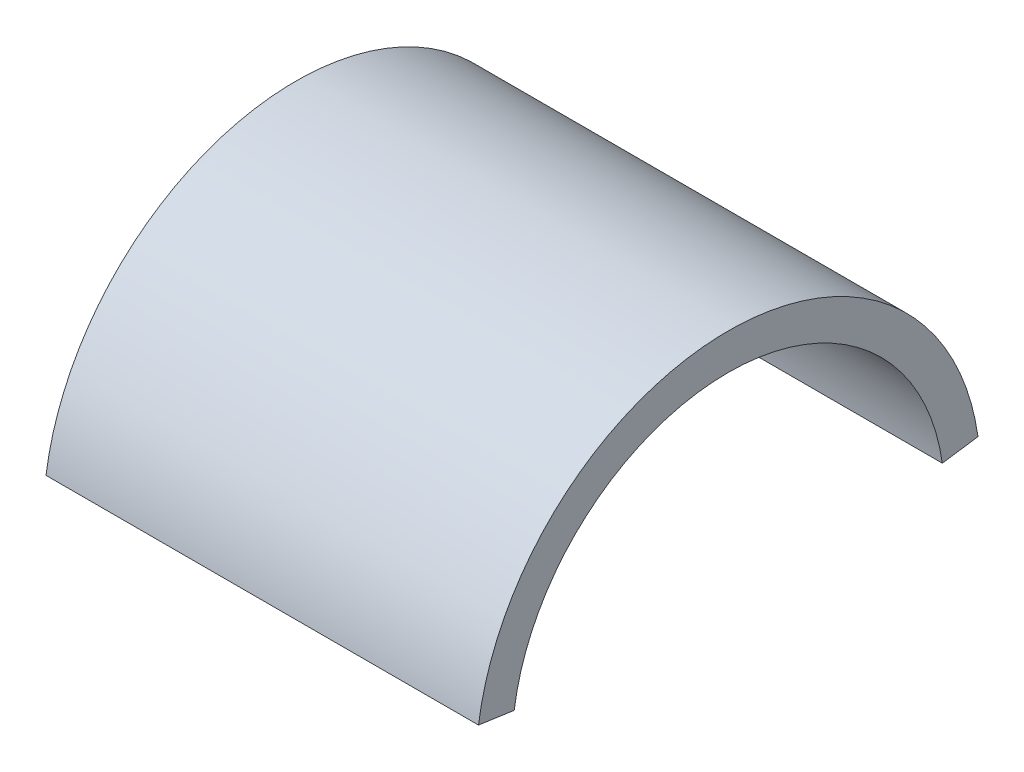
ISO-10303-21;
HEADER;
FILE_DESCRIPTION(('STEP AP214'),'2;1');
FILE_NAME('part.step','',(''),(''),'','','');
FILE_SCHEMA(('AUTOMOTIVE_DESIGN { 1 0 10303 214 1 1 1 1 }'));
ENDSEC;
DATA;
#1=APPLICATION_CONTEXT('core data for automotive mechanical design processes');
#2=APPLICATION_PROTOCOL_DEFINITION('international standard','automotive_design',2000,#1);
#3=PRODUCT_CONTEXT('',#1,'mechanical');
#4=PRODUCT('Part','Part','',(#3));
#5=PRODUCT_RELATED_PRODUCT_CATEGORY('part','',(#4));
#6=PRODUCT_DEFINITION_FORMATION('','',#4);
#7=PRODUCT_DEFINITION_CONTEXT('part definition',#1,'design');
#8=PRODUCT_DEFINITION('design','',#6,#7);
#9=PRODUCT_DEFINITION_SHAPE('','',#8);
#10=(LENGTH_UNIT() NAMED_UNIT(*) SI_UNIT(.MILLI.,.METRE.));
#11=(NAMED_UNIT(*) PLANE_ANGLE_UNIT() SI_UNIT($,.RADIAN.));
#12=(NAMED_UNIT(*) SI_UNIT($,.STERADIAN.) SOLID_ANGLE_UNIT());
#13=UNCERTAINTY_MEASURE_WITH_UNIT(LENGTH_MEASURE(1.E-05),#10,'distance_accuracy_value','');
#14=(GEOMETRIC_REPRESENTATION_CONTEXT(3) GLOBAL_UNCERTAINTY_ASSIGNED_CONTEXT((#13)) GLOBAL_UNIT_ASSIGNED_CONTEXT((#10,
#11,#12)) REPRESENTATION_CONTEXT('',''));
#15=CARTESIAN_POINT('',(0.,0.,0.));
#16=DIRECTION('',(0.,0.,1.));
#17=DIRECTION('',(1.,0.,0.));
#18=AXIS2_PLACEMENT_3D('',#15,#16,#17);
#19=CARTESIAN_POINT('',(92.075,258.7625,-3.15087519010365E-13));
#20=DIRECTION('',(-1.,0.,0.));
#21=DIRECTION('',(0.,0.,1.));
#22=AXIS2_PLACEMENT_3D('',#19,#20,#21);
#23=PLANE('',#22);
#24=CARTESIAN_POINT('',(92.075,258.7625,-3.15087519010365E-13));
#25=DIRECTION('',(1.,0.,0.));
#26=DIRECTION('',(0.,0.,1.));
#27=AXIS2_PLACEMENT_3D('',#24,#25,#26);
#28=CIRCLE('',#27,22.225);
#29=CARTESIAN_POINT('',(92.075,261.912802566522,-22.0005958723708));
#30=VERTEX_POINT('',#29);
#31=CARTESIAN_POINT('',(92.0750000000001,261.912802566522,22.0005958723701));
#32=VERTEX_POINT('',#31);
#33=EDGE_CURVE('E73',#30,#32,#28,.T.);
#34=ORIENTED_EDGE('',*,*,#33,.T.);
#35=DIRECTION('',(0.,-0.141745897256342,-0.989903076372124));
#36=VECTOR('',#35,1.);
#37=CARTESIAN_POINT('',(92.0750000000001,261.912802566522,22.0005958723701));
#38=LINE('',#37,#36);
#39=CARTESIAN_POINT('',(92.0750000000001,261.462759342733,18.8576536048886));
#40=VERTEX_POINT('',#39);
#41=EDGE_CURVE('E68',#32,#40,#38,.T.);
#42=ORIENTED_EDGE('',*,*,#41,.T.);
#43=CARTESIAN_POINT('',(92.075,258.7625,-3.13352795534388E-13));
#44=DIRECTION('',(-1.,0.,0.));
#45=DIRECTION('',(0.,0.,1.));
#46=AXIS2_PLACEMENT_3D('',#43,#44,#45);
#47=CIRCLE('',#46,19.05);
#48=CARTESIAN_POINT('',(92.075,261.462759342733,-18.8576536048893));
#49=VERTEX_POINT('',#48);
#50=EDGE_CURVE('E85',#40,#49,#47,.T.);
#51=ORIENTED_EDGE('',*,*,#50,.T.);
#52=DIRECTION('',(0.,0.141745897256342,-0.989903076372124));
#53=VECTOR('',#52,1.);
#54=CARTESIAN_POINT('',(92.075,261.462759342733,-18.8576536048893));
#55=LINE('',#54,#53);
#56=EDGE_CURVE('E78',#49,#30,#55,.T.);
#57=ORIENTED_EDGE('',*,*,#56,.T.);
#58=EDGE_LOOP('',(#34,#42,#51,#57));
#59=FACE_BOUND('',#58,.T.);
#60=ADVANCED_FACE('F33',(#59),#23,.F.);
#61=CARTESIAN_POINT('',(53.9750000000001,258.7625,-1.83248534836128E-13));
#62=DIRECTION('',(-1.,0.,0.));
#63=DIRECTION('',(0.,0.,1.));
#64=AXIS2_PLACEMENT_3D('',#61,#62,#63);
#65=PLANE('',#64);
#66=CARTESIAN_POINT('',(53.9750000000001,258.7625,-1.83248534836128E-13));
#67=DIRECTION('',(1.,0.,0.));
#68=DIRECTION('',(0.,0.,1.));
#69=AXIS2_PLACEMENT_3D('',#66,#67,#68);
#70=CIRCLE('',#69,22.225);
#71=CARTESIAN_POINT('',(53.975,261.912802566522,-22.0005958723706));
#72=VERTEX_POINT('',#71);
#73=CARTESIAN_POINT('',(53.9750000000002,261.912802566522,22.0005958723703));
#74=VERTEX_POINT('',#73);
#75=EDGE_CURVE('E47',#72,#74,#70,.T.);
#76=ORIENTED_EDGE('',*,*,#75,.F.);
#77=DIRECTION('',(0.,0.141745897256342,-0.989903076372124));
#78=VECTOR('',#77,1.);
#79=CARTESIAN_POINT('',(53.975,261.462759342733,-18.8576536048891));
#80=LINE('',#79,#78);
#81=CARTESIAN_POINT('',(53.975,261.462759342733,-18.8576536048891));
#82=VERTEX_POINT('',#81);
#83=EDGE_CURVE('E56',#82,#72,#80,.T.);
#84=ORIENTED_EDGE('',*,*,#83,.F.);
#85=CARTESIAN_POINT('',(53.9750000000001,258.7625,-1.81513811360151E-13));
#86=DIRECTION('',(-1.,0.,0.));
#87=DIRECTION('',(0.,0.,1.));
#88=AXIS2_PLACEMENT_3D('',#85,#86,#87);
#89=CIRCLE('',#88,19.05);
#90=CARTESIAN_POINT('',(53.9750000000001,261.462759342733,18.8576536048888));
#91=VERTEX_POINT('',#90);
#92=EDGE_CURVE('E93',#91,#82,#89,.T.);
#93=ORIENTED_EDGE('',*,*,#92,.F.);
#94=DIRECTION('',(0.,-0.141745897256342,-0.989903076372124));
#95=VECTOR('',#94,1.);
#96=CARTESIAN_POINT('',(53.9750000000001,261.912802566522,22.0005958723703));
#97=LINE('',#96,#95);
#98=EDGE_CURVE('E11',#74,#91,#97,.T.);
#99=ORIENTED_EDGE('',*,*,#98,.F.);
#100=EDGE_LOOP('',(#76,#84,#93,#99));
#101=FACE_BOUND('',#100,.T.);
#102=ADVANCED_FACE('F115',(#101),#65,.T.);
#103=CARTESIAN_POINT('',(92.075,258.7625,-3.13352795534388E-13));
#104=DIRECTION('',(-1.,0.,0.));
#105=DIRECTION('',(0.,0.,1.));
#106=AXIS2_PLACEMENT_3D('',#103,#104,#105);
#107=CYLINDRICAL_SURFACE('',#106,19.05);
#108=DIRECTION('',(-1.,0.,0.));
#109=VECTOR('',#108,1.);
#110=CARTESIAN_POINT('',(92.075,261.462759342733,-18.8576536048893));
#111=LINE('',#110,#109);
#112=EDGE_CURVE('E88',#49,#82,#111,.T.);
#113=ORIENTED_EDGE('',*,*,#112,.F.);
#114=ORIENTED_EDGE('',*,*,#50,.F.);
#115=DIRECTION('',(-1.,0.,0.));
#116=VECTOR('',#115,1.);
#117=CARTESIAN_POINT('',(92.0750000000001,261.462759342733,18.8576536048886));
#118=LINE('',#117,#116);
#119=EDGE_CURVE('E87',#40,#91,#118,.T.);
#120=ORIENTED_EDGE('',*,*,#119,.T.);
#121=ORIENTED_EDGE('',*,*,#92,.T.);
#122=EDGE_LOOP('',(#113,#114,#120,#121));
#123=FACE_BOUND('',#122,.T.);
#124=ADVANCED_FACE('F86',(#123),#107,.F.);
#125=CARTESIAN_POINT('',(92.075,261.462759342733,-18.8576536048893));
#126=DIRECTION('',(0.,0.989903076372124,0.141745897256342));
#127=DIRECTION('',(0.,-0.141745897256342,0.989903076372124));
#128=AXIS2_PLACEMENT_3D('',#125,#126,#127);
#129=PLANE('',#128);
#130=DIRECTION('',(-1.,0.,0.));
#131=VECTOR('',#130,1.);
#132=CARTESIAN_POINT('',(92.075,261.912802566522,-22.0005958723708));
#133=LINE('',#132,#131);
#134=EDGE_CURVE('E100',#30,#72,#133,.T.);
#135=ORIENTED_EDGE('',*,*,#134,.F.);
#136=ORIENTED_EDGE('',*,*,#56,.F.);
#137=ORIENTED_EDGE('',*,*,#112,.T.);
#138=ORIENTED_EDGE('',*,*,#83,.T.);
#139=EDGE_LOOP('',(#135,#136,#137,#138));
#140=FACE_BOUND('',#139,.T.);
#141=ADVANCED_FACE('F106',(#140),#129,.F.);
#142=CARTESIAN_POINT('',(92.075,258.7625,-3.15087519010365E-13));
#143=DIRECTION('',(-1.,0.,0.));
#144=DIRECTION('',(0.,0.,1.));
#145=AXIS2_PLACEMENT_3D('',#142,#143,#144);
#146=CYLINDRICAL_SURFACE('',#145,22.225);
#147=DIRECTION('',(-1.,0.,0.));
#148=VECTOR('',#147,1.);
#149=CARTESIAN_POINT('',(92.0750000000001,261.912802566522,22.0005958723701));
#150=LINE('',#149,#148);
#151=EDGE_CURVE('E40',#32,#74,#150,.T.);
#152=ORIENTED_EDGE('',*,*,#151,.F.);
#153=ORIENTED_EDGE('',*,*,#33,.F.);
#154=ORIENTED_EDGE('',*,*,#134,.T.);
#155=ORIENTED_EDGE('',*,*,#75,.T.);
#156=EDGE_LOOP('',(#152,#153,#154,#155));
#157=FACE_BOUND('',#156,.T.);
#158=ADVANCED_FACE('F104',(#157),#146,.T.);
#159=CARTESIAN_POINT('',(92.0750000000001,261.912802566522,22.0005958723701));
#160=DIRECTION('',(0.,0.989903076372124,-0.141745897256342));
#161=DIRECTION('',(0.,0.141745897256342,0.989903076372124));
#162=AXIS2_PLACEMENT_3D('',#159,#160,#161);
#163=PLANE('',#162);
#164=ORIENTED_EDGE('',*,*,#98,.T.);
#165=ORIENTED_EDGE('',*,*,#119,.F.);
#166=ORIENTED_EDGE('',*,*,#41,.F.);
#167=ORIENTED_EDGE('',*,*,#151,.T.);
#168=EDGE_LOOP('',(#164,#165,#166,#167));
#169=FACE_BOUND('',#168,.T.);
#170=ADVANCED_FACE('F91',(#169),#163,.F.);
#171=CLOSED_SHELL('',(#60,#102,#124,#141,#158,#170));
#172=MANIFOLD_SOLID_BREP('B2',#171);
#173=ADVANCED_BREP_SHAPE_REPRESENTATION('',(#18,#172),#14);
#174=SHAPE_DEFINITION_REPRESENTATION(#9,#173);
ENDSEC;
END-ISO-10303-21;
